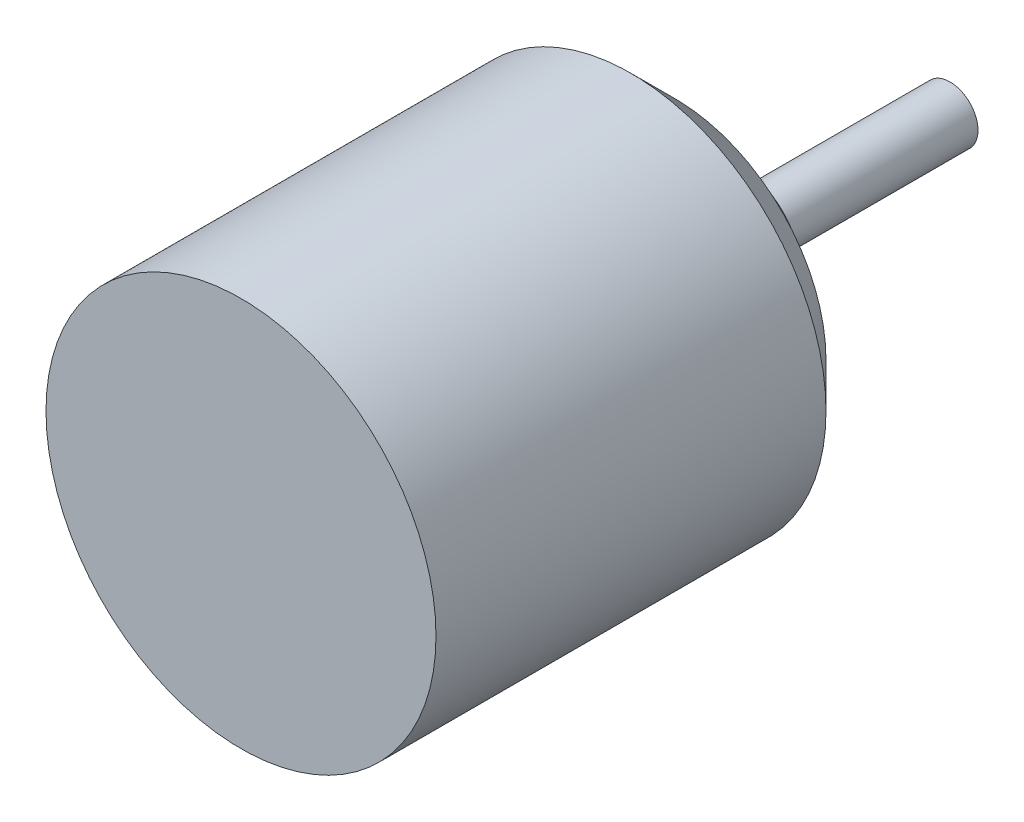
ISO-10303-21;
HEADER;
FILE_DESCRIPTION(('STEP AP214'),'2;1');
FILE_NAME('part.step','',(''),(''),'','','');
FILE_SCHEMA(('AUTOMOTIVE_DESIGN { 1 0 10303 214 1 1 1 1 }'));
ENDSEC;
DATA;
#1=APPLICATION_CONTEXT('core data for automotive mechanical design processes');
#2=APPLICATION_PROTOCOL_DEFINITION('international standard','automotive_design',2000,#1);
#3=PRODUCT_CONTEXT('',#1,'mechanical');
#4=PRODUCT('Part','Part','',(#3));
#5=PRODUCT_RELATED_PRODUCT_CATEGORY('part','',(#4));
#6=PRODUCT_DEFINITION_FORMATION('','',#4);
#7=PRODUCT_DEFINITION_CONTEXT('part definition',#1,'design');
#8=PRODUCT_DEFINITION('design','',#6,#7);
#9=PRODUCT_DEFINITION_SHAPE('','',#8);
#10=(LENGTH_UNIT() NAMED_UNIT(*) SI_UNIT(.MILLI.,.METRE.));
#11=(NAMED_UNIT(*) PLANE_ANGLE_UNIT() SI_UNIT($,.RADIAN.));
#12=(NAMED_UNIT(*) SI_UNIT($,.STERADIAN.) SOLID_ANGLE_UNIT());
#13=UNCERTAINTY_MEASURE_WITH_UNIT(LENGTH_MEASURE(1.E-05),#10,'distance_accuracy_value','');
#14=(GEOMETRIC_REPRESENTATION_CONTEXT(3) GLOBAL_UNCERTAINTY_ASSIGNED_CONTEXT((#13)) GLOBAL_UNIT_ASSIGNED_CONTEXT((#10,
#11,#12)) REPRESENTATION_CONTEXT('',''));
#15=CARTESIAN_POINT('',(0.,0.,0.));
#16=DIRECTION('',(0.,0.,1.));
#17=DIRECTION('',(1.,0.,0.));
#18=AXIS2_PLACEMENT_3D('',#15,#16,#17);
#19=CARTESIAN_POINT('',(0.,0.,0.));
#20=DIRECTION('',(0.,0.,-1.));
#21=DIRECTION('',(-1.,0.,0.));
#22=AXIS2_PLACEMENT_3D('',#19,#20,#21);
#23=PLANE('',#22);
#24=CARTESIAN_POINT('',(0.,0.,0.));
#25=DIRECTION('',(0.,0.,1.));
#26=DIRECTION('',(1.,0.,0.));
#27=AXIS2_PLACEMENT_3D('',#24,#25,#26);
#28=CIRCLE('',#27,13.97);
#29=CARTESIAN_POINT('',(13.97,0.,0.));
#30=VERTEX_POINT('',#29);
#31=EDGE_CURVE('E10',#30,#30,#28,.T.);
#32=ORIENTED_EDGE('',*,*,#31,.T.);
#33=EDGE_LOOP('',(#32));
#34=FACE_BOUND('',#33,.T.);
#35=ADVANCED_FACE('F33',(#34),#23,.F.);
#36=CARTESIAN_POINT('',(0.,0.,48.7325837036241));
#37=DIRECTION('',(0.,0.,1.));
#38=DIRECTION('',(1.,0.,0.));
#39=AXIS2_PLACEMENT_3D('',#36,#37,#38);
#40=CYLINDRICAL_SURFACE('',#39,13.97);
#41=ORIENTED_EDGE('',*,*,#31,.F.);
#42=EDGE_LOOP('',(#41));
#43=FACE_BOUND('',#42,.T.);
#44=CARTESIAN_POINT('',(0.,0.,-27.94));
#45=DIRECTION('',(0.,0.,1.));
#46=DIRECTION('',(1.,0.,0.));
#47=AXIS2_PLACEMENT_3D('',#44,#45,#46);
#48=CIRCLE('',#47,13.97);
#49=CARTESIAN_POINT('',(13.97,0.,-27.94));
#50=VERTEX_POINT('',#49);
#51=EDGE_CURVE('E39',#50,#50,#48,.T.);
#52=ORIENTED_EDGE('',*,*,#51,.T.);
#53=EDGE_LOOP('',(#52));
#54=FACE_BOUND('',#53,.T.);
#55=ADVANCED_FACE('F74',(#43,#54),#40,.T.);
#56=CARTESIAN_POINT('',(0.,0.,-31.115));
#57=DIRECTION('',(0.,0.,1.));
#58=DIRECTION('',(1.,0.,0.));
#59=AXIS2_PLACEMENT_3D('',#56,#57,#58);
#60=CONICAL_SURFACE('',#59,10.795,0.785398163397449);
#61=ORIENTED_EDGE('',*,*,#51,.F.);
#62=EDGE_LOOP('',(#61));
#63=FACE_BOUND('',#62,.T.);
#64=CARTESIAN_POINT('',(0.,0.,-31.115));
#65=DIRECTION('',(0.,0.,1.));
#66=DIRECTION('',(1.,0.,0.));
#67=AXIS2_PLACEMENT_3D('',#64,#65,#66);
#68=CIRCLE('',#67,10.795);
#69=CARTESIAN_POINT('',(10.795,0.,-31.115));
#70=VERTEX_POINT('',#69);
#71=EDGE_CURVE('E43',#70,#70,#68,.T.);
#72=ORIENTED_EDGE('',*,*,#71,.T.);
#73=EDGE_LOOP('',(#72));
#74=FACE_BOUND('',#73,.T.);
#75=ADVANCED_FACE('F78',(#63,#74),#60,.T.);
#76=CARTESIAN_POINT('',(0.,10.795,-31.115));
#77=DIRECTION('',(0.,0.,1.));
#78=DIRECTION('',(1.,0.,0.));
#79=AXIS2_PLACEMENT_3D('',#76,#77,#78);
#80=PLANE('',#79);
#81=ORIENTED_EDGE('',*,*,#71,.F.);
#82=EDGE_LOOP('',(#81));
#83=FACE_BOUND('',#82,.T.);
#84=CARTESIAN_POINT('',(0.,0.,-31.115));
#85=DIRECTION('',(0.,0.,1.));
#86=DIRECTION('',(1.,0.,0.));
#87=AXIS2_PLACEMENT_3D('',#84,#85,#86);
#88=CIRCLE('',#87,4.572);
#89=CARTESIAN_POINT('',(4.572,0.,-31.115));
#90=VERTEX_POINT('',#89);
#91=EDGE_CURVE('E47',#90,#90,#88,.T.);
#92=ORIENTED_EDGE('',*,*,#91,.T.);
#93=EDGE_LOOP('',(#92));
#94=FACE_BOUND('',#93,.T.);
#95=ADVANCED_FACE('F83',(#83,#94),#80,.F.);
#96=CARTESIAN_POINT('',(0.,0.,48.7325837036241));
#97=DIRECTION('',(0.,0.,1.));
#98=DIRECTION('',(1.,0.,0.));
#99=AXIS2_PLACEMENT_3D('',#96,#97,#98);
#100=CYLINDRICAL_SURFACE('',#99,4.572);
#101=ORIENTED_EDGE('',*,*,#91,.F.);
#102=EDGE_LOOP('',(#101));
#103=FACE_BOUND('',#102,.T.);
#104=CARTESIAN_POINT('',(0.,0.,-35.56));
#105=DIRECTION('',(0.,0.,1.));
#106=DIRECTION('',(1.,0.,0.));
#107=AXIS2_PLACEMENT_3D('',#104,#105,#106);
#108=CIRCLE('',#107,4.572);
#109=CARTESIAN_POINT('',(4.572,0.,-35.56));
#110=VERTEX_POINT('',#109);
#111=EDGE_CURVE('E52',#110,#110,#108,.T.);
#112=ORIENTED_EDGE('',*,*,#111,.T.);
#113=EDGE_LOOP('',(#112));
#114=FACE_BOUND('',#113,.T.);
#115=ADVANCED_FACE('F89',(#103,#114),#100,.T.);
#116=CARTESIAN_POINT('',(0.,4.572,-35.56));
#117=DIRECTION('',(0.,0.,1.));
#118=DIRECTION('',(1.,0.,0.));
#119=AXIS2_PLACEMENT_3D('',#116,#117,#118);
#120=PLANE('',#119);
#121=ORIENTED_EDGE('',*,*,#111,.F.);
#122=EDGE_LOOP('',(#121));
#123=FACE_BOUND('',#122,.T.);
#124=CARTESIAN_POINT('',(0.,0.,-35.56));
#125=DIRECTION('',(0.,0.,1.));
#126=DIRECTION('',(1.,0.,0.));
#127=AXIS2_PLACEMENT_3D('',#124,#125,#126);
#128=CIRCLE('',#127,2.);
#129=CARTESIAN_POINT('',(2.,0.,-35.56));
#130=VERTEX_POINT('',#129);
#131=EDGE_CURVE('E55',#130,#130,#128,.T.);
#132=ORIENTED_EDGE('',*,*,#131,.T.);
#133=EDGE_LOOP('',(#132));
#134=FACE_BOUND('',#133,.T.);
#135=ADVANCED_FACE('F70',(#123,#134),#120,.F.);
#136=CARTESIAN_POINT('',(0.,0.,48.7325837036241));
#137=DIRECTION('',(0.,0.,1.));
#138=DIRECTION('',(1.,0.,0.));
#139=AXIS2_PLACEMENT_3D('',#136,#137,#138);
#140=CYLINDRICAL_SURFACE('',#139,2.);
#141=ORIENTED_EDGE('',*,*,#131,.F.);
#142=EDGE_LOOP('',(#141));
#143=FACE_BOUND('',#142,.T.);
#144=CARTESIAN_POINT('',(0.,0.,-50.8));
#145=DIRECTION('',(0.,0.,1.));
#146=DIRECTION('',(1.,0.,0.));
#147=AXIS2_PLACEMENT_3D('',#144,#145,#146);
#148=CIRCLE('',#147,2.);
#149=CARTESIAN_POINT('',(2.,0.,-50.8));
#150=VERTEX_POINT('',#149);
#151=EDGE_CURVE('E58',#150,#150,#148,.T.);
#152=ORIENTED_EDGE('',*,*,#151,.T.);
#153=EDGE_LOOP('',(#152));
#154=FACE_BOUND('',#153,.T.);
#155=ADVANCED_FACE('F62',(#143,#154),#140,.T.);
#156=CARTESIAN_POINT('',(0.,2.,-50.8));
#157=DIRECTION('',(0.,0.,1.));
#158=DIRECTION('',(1.,0.,0.));
#159=AXIS2_PLACEMENT_3D('',#156,#157,#158);
#160=PLANE('',#159);
#161=ORIENTED_EDGE('',*,*,#151,.F.);
#162=EDGE_LOOP('',(#161));
#163=FACE_BOUND('',#162,.T.);
#164=ADVANCED_FACE('F64',(#163),#160,.F.);
#165=CLOSED_SHELL('',(#35,#55,#75,#95,#115,#135,#155,#164));
#166=MANIFOLD_SOLID_BREP('B2',#165);
#167=ADVANCED_BREP_SHAPE_REPRESENTATION('',(#18,#166),#14);
#168=SHAPE_DEFINITION_REPRESENTATION(#9,#167);
ENDSEC;
END-ISO-10303-21;
